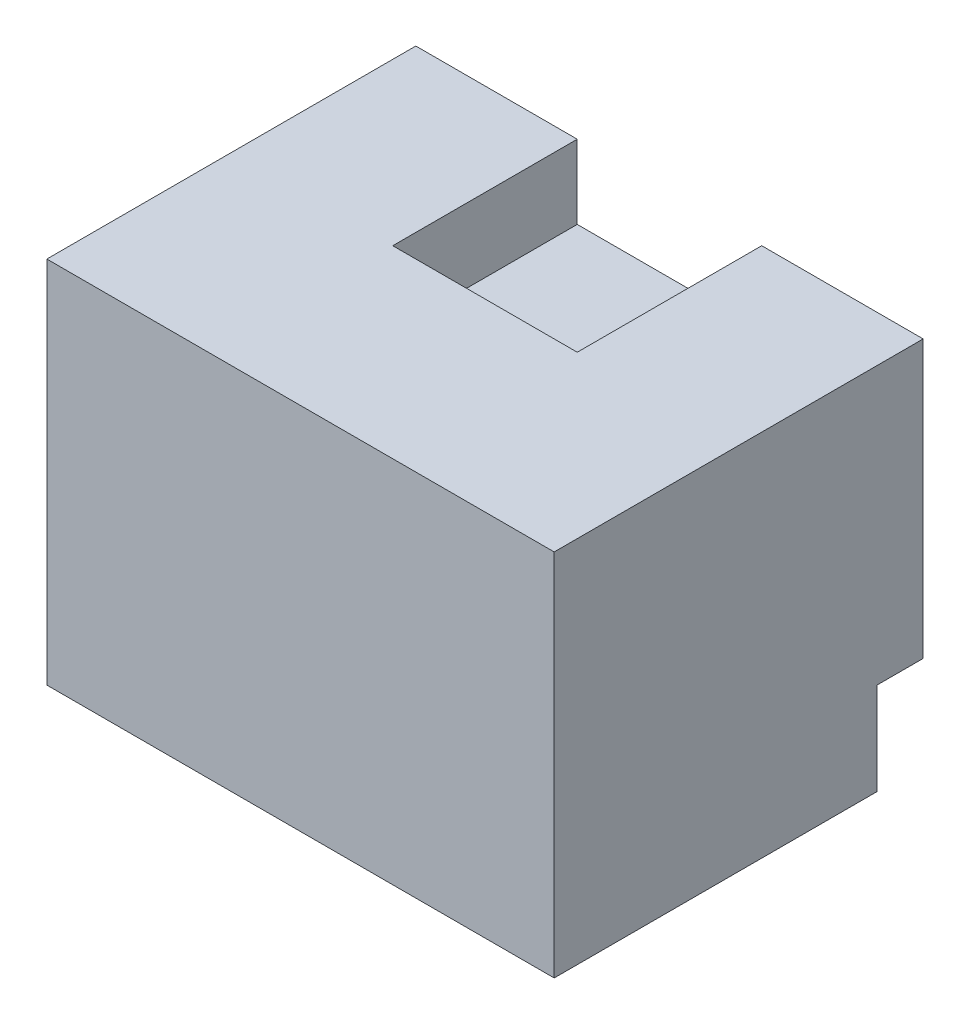
ISO-10303-21;
HEADER;
FILE_DESCRIPTION(('STEP AP214'),'2;1');
FILE_NAME('part.step','',(''),(''),'','','');
FILE_SCHEMA(('AUTOMOTIVE_DESIGN { 1 0 10303 214 1 1 1 1 }'));
ENDSEC;
DATA;
#1=APPLICATION_CONTEXT('core data for automotive mechanical design processes');
#2=APPLICATION_PROTOCOL_DEFINITION('international standard','automotive_design',2000,#1);
#3=PRODUCT_CONTEXT('',#1,'mechanical');
#4=PRODUCT('Part','Part','',(#3));
#5=PRODUCT_RELATED_PRODUCT_CATEGORY('part','',(#4));
#6=PRODUCT_DEFINITION_FORMATION('','',#4);
#7=PRODUCT_DEFINITION_CONTEXT('part definition',#1,'design');
#8=PRODUCT_DEFINITION('design','',#6,#7);
#9=PRODUCT_DEFINITION_SHAPE('','',#8);
#10=(LENGTH_UNIT() NAMED_UNIT(*) SI_UNIT(.MILLI.,.METRE.));
#11=(NAMED_UNIT(*) PLANE_ANGLE_UNIT() SI_UNIT($,.RADIAN.));
#12=(NAMED_UNIT(*) SI_UNIT($,.STERADIAN.) SOLID_ANGLE_UNIT());
#13=UNCERTAINTY_MEASURE_WITH_UNIT(LENGTH_MEASURE(1.E-05),#10,'distance_accuracy_value','');
#14=(GEOMETRIC_REPRESENTATION_CONTEXT(3) GLOBAL_UNCERTAINTY_ASSIGNED_CONTEXT((#13)) GLOBAL_UNIT_ASSIGNED_CONTEXT((#10,
#11,#12)) REPRESENTATION_CONTEXT('',''));
#15=CARTESIAN_POINT('',(0.,0.,0.));
#16=DIRECTION('',(0.,0.,1.));
#17=DIRECTION('',(1.,0.,0.));
#18=AXIS2_PLACEMENT_3D('',#15,#16,#17);
#19=CARTESIAN_POINT('',(0.,0.,0.));
#20=DIRECTION('',(0.,1.,0.));
#21=DIRECTION('',(0.,0.,1.));
#22=AXIS2_PLACEMENT_3D('',#19,#20,#21);
#23=PLANE('',#22);
#24=DIRECTION('',(1.,0.,0.));
#25=VECTOR('',#24,1.);
#26=CARTESIAN_POINT('',(27.5,0.,4.99999999999998));
#27=LINE('',#26,#25);
#28=CARTESIAN_POINT('',(-27.5,0.,4.99999999999998));
#29=VERTEX_POINT('',#28);
#30=CARTESIAN_POINT('',(27.5,0.,4.99999999999998));
#31=VERTEX_POINT('',#30);
#32=EDGE_CURVE('E59',#29,#31,#27,.T.);
#33=ORIENTED_EDGE('',*,*,#32,.F.);
#34=DIRECTION('',(0.,0.,1.));
#35=VECTOR('',#34,1.);
#36=CARTESIAN_POINT('',(-27.5,0.,0.));
#37=LINE('',#36,#35);
#38=CARTESIAN_POINT('',(-27.5,0.,0.));
#39=VERTEX_POINT('',#38);
#40=EDGE_CURVE('E180',#39,#29,#37,.T.);
#41=ORIENTED_EDGE('',*,*,#40,.F.);
#42=DIRECTION('',(1.,0.,0.));
#43=VECTOR('',#42,1.);
#44=CARTESIAN_POINT('',(0.,0.,0.));
#45=LINE('',#44,#43);
#46=CARTESIAN_POINT('',(27.5,0.,0.));
#47=VERTEX_POINT('',#46);
#48=EDGE_CURVE('E186',#39,#47,#45,.T.);
#49=ORIENTED_EDGE('',*,*,#48,.T.);
#50=DIRECTION('',(0.,0.,1.));
#51=VECTOR('',#50,1.);
#52=CARTESIAN_POINT('',(27.5,0.,0.));
#53=LINE('',#52,#51);
#54=EDGE_CURVE('E209',#47,#31,#53,.T.);
#55=ORIENTED_EDGE('',*,*,#54,.T.);
#56=EDGE_LOOP('',(#33,#41,#49,#55));
#57=FACE_BOUND('',#56,.T.);
#58=ADVANCED_FACE('F43',(#57),#23,.F.);
#59=CARTESIAN_POINT('',(0.,30.,20.));
#60=DIRECTION('',(0.,0.,1.));
#61=DIRECTION('',(1.,0.,0.));
#62=AXIS2_PLACEMENT_3D('',#59,#60,#61);
#63=PLANE('',#62);
#64=DIRECTION('',(0.,-1.,0.));
#65=VECTOR('',#64,1.);
#66=CARTESIAN_POINT('',(10.,30.,20.));
#67=LINE('',#66,#65);
#68=CARTESIAN_POINT('',(10.,30.,20.));
#69=VERTEX_POINT('',#68);
#70=CARTESIAN_POINT('',(10.,22.,20.));
#71=VERTEX_POINT('',#70);
#72=EDGE_CURVE('E205',#69,#71,#67,.T.);
#73=ORIENTED_EDGE('',*,*,#72,.T.);
#74=DIRECTION('',(-1.,0.,0.));
#75=VECTOR('',#74,1.);
#76=CARTESIAN_POINT('',(10.,22.,20.));
#77=LINE('',#76,#75);
#78=CARTESIAN_POINT('',(-9.99999999999999,22.,20.));
#79=VERTEX_POINT('',#78);
#80=EDGE_CURVE('E67',#71,#79,#77,.T.);
#81=ORIENTED_EDGE('',*,*,#80,.T.);
#82=DIRECTION('',(0.,-1.,0.));
#83=VECTOR('',#82,1.);
#84=CARTESIAN_POINT('',(-9.99999999999999,30.,20.));
#85=LINE('',#84,#83);
#86=CARTESIAN_POINT('',(-9.99999999999999,30.,20.));
#87=VERTEX_POINT('',#86);
#88=EDGE_CURVE('E11',#87,#79,#85,.T.);
#89=ORIENTED_EDGE('',*,*,#88,.F.);
#90=DIRECTION('',(-1.,0.,0.));
#91=VECTOR('',#90,1.);
#92=CARTESIAN_POINT('',(0.,30.,20.));
#93=LINE('',#92,#91);
#94=EDGE_CURVE('E181',#69,#87,#93,.T.);
#95=ORIENTED_EDGE('',*,*,#94,.F.);
#96=EDGE_LOOP('',(#73,#81,#89,#95));
#97=FACE_BOUND('',#96,.T.);
#98=ADVANCED_FACE('F45',(#97),#63,.F.);
#99=CARTESIAN_POINT('',(-9.99999999999999,30.,0.));
#100=DIRECTION('',(-1.,0.,0.));
#101=DIRECTION('',(0.,0.,1.));
#102=AXIS2_PLACEMENT_3D('',#99,#100,#101);
#103=PLANE('',#102);
#104=ORIENTED_EDGE('',*,*,#88,.T.);
#105=DIRECTION('',(0.,0.,-1.));
#106=VECTOR('',#105,1.);
#107=CARTESIAN_POINT('',(-9.99999999999999,22.,20.));
#108=LINE('',#107,#106);
#109=CARTESIAN_POINT('',(-9.99999999999999,22.,0.));
#110=VERTEX_POINT('',#109);
#111=EDGE_CURVE('E173',#79,#110,#108,.T.);
#112=ORIENTED_EDGE('',*,*,#111,.T.);
#113=DIRECTION('',(0.,-1.,0.));
#114=VECTOR('',#113,1.);
#115=CARTESIAN_POINT('',(-9.99999999999999,30.,0.));
#116=LINE('',#115,#114);
#117=CARTESIAN_POINT('',(-9.99999999999999,30.,0.));
#118=VERTEX_POINT('',#117);
#119=EDGE_CURVE('E52',#118,#110,#116,.T.);
#120=ORIENTED_EDGE('',*,*,#119,.F.);
#121=DIRECTION('',(0.,0.,-1.));
#122=VECTOR('',#121,1.);
#123=CARTESIAN_POINT('',(-9.99999999999999,30.,0.));
#124=LINE('',#123,#122);
#125=EDGE_CURVE('E185',#87,#118,#124,.T.);
#126=ORIENTED_EDGE('',*,*,#125,.F.);
#127=EDGE_LOOP('',(#104,#112,#120,#126));
#128=FACE_BOUND('',#127,.T.);
#129=ADVANCED_FACE('F270',(#128),#103,.F.);
#130=CARTESIAN_POINT('',(-27.5,30.,0.));
#131=DIRECTION('',(1.,0.,0.));
#132=DIRECTION('',(0.,0.,-1.));
#133=AXIS2_PLACEMENT_3D('',#130,#131,#132);
#134=PLANE('',#133);
#135=ORIENTED_EDGE('',*,*,#40,.T.);
#136=DIRECTION('',(0.,1.,0.));
#137=VECTOR('',#136,1.);
#138=CARTESIAN_POINT('',(-27.5,-10.,4.99999999999998));
#139=LINE('',#138,#137);
#140=CARTESIAN_POINT('',(-27.5,-10.,4.99999999999998));
#141=VERTEX_POINT('',#140);
#142=EDGE_CURVE('E164',#141,#29,#139,.T.);
#143=ORIENTED_EDGE('',*,*,#142,.F.);
#144=DIRECTION('',(0.,0.,-1.));
#145=VECTOR('',#144,1.);
#146=CARTESIAN_POINT('',(-27.5,-10.,40.));
#147=LINE('',#146,#145);
#148=CARTESIAN_POINT('',(-27.5,-10.,40.));
#149=VERTEX_POINT('',#148);
#150=EDGE_CURVE('E146',#149,#141,#147,.T.);
#151=ORIENTED_EDGE('',*,*,#150,.F.);
#152=DIRECTION('',(0.,-1.,0.));
#153=VECTOR('',#152,1.);
#154=CARTESIAN_POINT('',(-27.5,30.,40.));
#155=LINE('',#154,#153);
#156=CARTESIAN_POINT('',(-27.5,30.,40.));
#157=VERTEX_POINT('',#156);
#158=EDGE_CURVE('E136',#157,#149,#155,.T.);
#159=ORIENTED_EDGE('',*,*,#158,.F.);
#160=DIRECTION('',(0.,0.,1.));
#161=VECTOR('',#160,1.);
#162=CARTESIAN_POINT('',(-27.5,30.,0.));
#163=LINE('',#162,#161);
#164=CARTESIAN_POINT('',(-27.5,30.,0.));
#165=VERTEX_POINT('',#164);
#166=EDGE_CURVE('E193',#165,#157,#163,.T.);
#167=ORIENTED_EDGE('',*,*,#166,.F.);
#168=DIRECTION('',(0.,-1.,0.));
#169=VECTOR('',#168,1.);
#170=CARTESIAN_POINT('',(-27.5,30.,0.));
#171=LINE('',#170,#169);
#172=EDGE_CURVE('E223',#165,#39,#171,.T.);
#173=ORIENTED_EDGE('',*,*,#172,.T.);
#174=EDGE_LOOP('',(#135,#143,#151,#159,#167,#173));
#175=FACE_BOUND('',#174,.T.);
#176=ADVANCED_FACE('F250',(#175),#134,.F.);
#177=CARTESIAN_POINT('',(0.,30.,40.));
#178=DIRECTION('',(0.,0.,-1.));
#179=DIRECTION('',(-1.,0.,0.));
#180=AXIS2_PLACEMENT_3D('',#177,#178,#179);
#181=PLANE('',#180);
#182=ORIENTED_EDGE('',*,*,#158,.T.);
#183=DIRECTION('',(-1.,0.,0.));
#184=VECTOR('',#183,1.);
#185=CARTESIAN_POINT('',(27.5,-10.,40.));
#186=LINE('',#185,#184);
#187=CARTESIAN_POINT('',(27.5,-10.,40.));
#188=VERTEX_POINT('',#187);
#189=EDGE_CURVE('E140',#188,#149,#186,.T.);
#190=ORIENTED_EDGE('',*,*,#189,.F.);
#191=DIRECTION('',(0.,-1.,0.));
#192=VECTOR('',#191,1.);
#193=CARTESIAN_POINT('',(27.5,30.,40.));
#194=LINE('',#193,#192);
#195=CARTESIAN_POINT('',(27.5,30.,40.));
#196=VERTEX_POINT('',#195);
#197=EDGE_CURVE('E124',#196,#188,#194,.T.);
#198=ORIENTED_EDGE('',*,*,#197,.F.);
#199=DIRECTION('',(1.,0.,0.));
#200=VECTOR('',#199,1.);
#201=CARTESIAN_POINT('',(0.,30.,40.));
#202=LINE('',#201,#200);
#203=EDGE_CURVE('E197',#157,#196,#202,.T.);
#204=ORIENTED_EDGE('',*,*,#203,.F.);
#205=EDGE_LOOP('',(#182,#190,#198,#204));
#206=FACE_BOUND('',#205,.T.);
#207=ADVANCED_FACE('F141',(#206),#181,.F.);
#208=CARTESIAN_POINT('',(27.5,30.,0.));
#209=DIRECTION('',(1.,0.,0.));
#210=DIRECTION('',(0.,0.,-1.));
#211=AXIS2_PLACEMENT_3D('',#208,#209,#210);
#212=PLANE('',#211);
#213=ORIENTED_EDGE('',*,*,#54,.F.);
#214=DIRECTION('',(0.,-1.,0.));
#215=VECTOR('',#214,1.);
#216=CARTESIAN_POINT('',(27.5,30.,0.));
#217=LINE('',#216,#215);
#218=CARTESIAN_POINT('',(27.5,30.,0.));
#219=VERTEX_POINT('',#218);
#220=EDGE_CURVE('E137',#219,#47,#217,.T.);
#221=ORIENTED_EDGE('',*,*,#220,.F.);
#222=DIRECTION('',(0.,0.,1.));
#223=VECTOR('',#222,1.);
#224=CARTESIAN_POINT('',(27.5,30.,0.));
#225=LINE('',#224,#223);
#226=EDGE_CURVE('E132',#219,#196,#225,.T.);
#227=ORIENTED_EDGE('',*,*,#226,.T.);
#228=ORIENTED_EDGE('',*,*,#197,.T.);
#229=DIRECTION('',(0.,0.,1.));
#230=VECTOR('',#229,1.);
#231=CARTESIAN_POINT('',(27.5,-10.,40.));
#232=LINE('',#231,#230);
#233=CARTESIAN_POINT('',(27.5,-10.,4.99999999999998));
#234=VERTEX_POINT('',#233);
#235=EDGE_CURVE('E130',#234,#188,#232,.T.);
#236=ORIENTED_EDGE('',*,*,#235,.F.);
#237=DIRECTION('',(0.,1.,0.));
#238=VECTOR('',#237,1.);
#239=CARTESIAN_POINT('',(27.5,-10.,4.99999999999998));
#240=LINE('',#239,#238);
#241=EDGE_CURVE('E160',#234,#31,#240,.T.);
#242=ORIENTED_EDGE('',*,*,#241,.T.);
#243=EDGE_LOOP('',(#213,#221,#227,#228,#236,#242));
#244=FACE_BOUND('',#243,.T.);
#245=ADVANCED_FACE('F127',(#244),#212,.T.);
#246=CARTESIAN_POINT('',(0.,30.,0.));
#247=DIRECTION('',(0.,0.,-1.));
#248=DIRECTION('',(-1.,0.,0.));
#249=AXIS2_PLACEMENT_3D('',#246,#247,#248);
#250=PLANE('',#249);
#251=ORIENTED_EDGE('',*,*,#48,.F.);
#252=ORIENTED_EDGE('',*,*,#172,.F.);
#253=DIRECTION('',(1.,0.,0.));
#254=VECTOR('',#253,1.);
#255=CARTESIAN_POINT('',(0.,30.,0.));
#256=LINE('',#255,#254);
#257=EDGE_CURVE('E189',#165,#118,#256,.T.);
#258=ORIENTED_EDGE('',*,*,#257,.T.);
#259=ORIENTED_EDGE('',*,*,#119,.T.);
#260=DIRECTION('',(1.,0.,0.));
#261=VECTOR('',#260,1.);
#262=CARTESIAN_POINT('',(10.,22.,0.));
#263=LINE('',#262,#261);
#264=CARTESIAN_POINT('',(10.,22.,0.));
#265=VERTEX_POINT('',#264);
#266=EDGE_CURVE('E176',#110,#265,#263,.T.);
#267=ORIENTED_EDGE('',*,*,#266,.T.);
#268=DIRECTION('',(0.,-1.,0.));
#269=VECTOR('',#268,1.);
#270=CARTESIAN_POINT('',(10.,30.,0.));
#271=LINE('',#270,#269);
#272=CARTESIAN_POINT('',(10.,30.,0.));
#273=VERTEX_POINT('',#272);
#274=EDGE_CURVE('E216',#273,#265,#271,.T.);
#275=ORIENTED_EDGE('',*,*,#274,.F.);
#276=EDGE_CURVE('E194',#273,#219,#256,.T.);
#277=ORIENTED_EDGE('',*,*,#276,.T.);
#278=ORIENTED_EDGE('',*,*,#220,.T.);
#279=EDGE_LOOP('',(#251,#252,#258,#259,#267,#275,#277,#278));
#280=FACE_BOUND('',#279,.T.);
#281=ADVANCED_FACE('F231',(#280),#250,.T.);
#282=CARTESIAN_POINT('',(10.,30.,0.));
#283=DIRECTION('',(1.,0.,0.));
#284=DIRECTION('',(0.,0.,-1.));
#285=AXIS2_PLACEMENT_3D('',#282,#283,#284);
#286=PLANE('',#285);
#287=ORIENTED_EDGE('',*,*,#274,.T.);
#288=DIRECTION('',(0.,0.,1.));
#289=VECTOR('',#288,1.);
#290=CARTESIAN_POINT('',(10.,22.,20.));
#291=LINE('',#290,#289);
#292=EDGE_CURVE('E168',#265,#71,#291,.T.);
#293=ORIENTED_EDGE('',*,*,#292,.T.);
#294=ORIENTED_EDGE('',*,*,#72,.F.);
#295=DIRECTION('',(0.,0.,1.));
#296=VECTOR('',#295,1.);
#297=CARTESIAN_POINT('',(10.,30.,0.));
#298=LINE('',#297,#296);
#299=EDGE_CURVE('E202',#273,#69,#298,.T.);
#300=ORIENTED_EDGE('',*,*,#299,.F.);
#301=EDGE_LOOP('',(#287,#293,#294,#300));
#302=FACE_BOUND('',#301,.T.);
#303=ADVANCED_FACE('F240',(#302),#286,.F.);
#304=CARTESIAN_POINT('',(0.,30.,0.));
#305=DIRECTION('',(0.,1.,0.));
#306=DIRECTION('',(0.,0.,1.));
#307=AXIS2_PLACEMENT_3D('',#304,#305,#306);
#308=PLANE('',#307);
#309=ORIENTED_EDGE('',*,*,#94,.T.);
#310=ORIENTED_EDGE('',*,*,#125,.T.);
#311=ORIENTED_EDGE('',*,*,#257,.F.);
#312=ORIENTED_EDGE('',*,*,#166,.T.);
#313=ORIENTED_EDGE('',*,*,#203,.T.);
#314=ORIENTED_EDGE('',*,*,#226,.F.);
#315=ORIENTED_EDGE('',*,*,#276,.F.);
#316=ORIENTED_EDGE('',*,*,#299,.T.);
#317=EDGE_LOOP('',(#309,#310,#311,#312,#313,#314,#315,#316));
#318=FACE_BOUND('',#317,.T.);
#319=ADVANCED_FACE('F244',(#318),#308,.T.);
#320=CARTESIAN_POINT('',(0.,22.,0.));
#321=DIRECTION('',(0.,1.,0.));
#322=DIRECTION('',(0.,0.,1.));
#323=AXIS2_PLACEMENT_3D('',#320,#321,#322);
#324=PLANE('',#323);
#325=ORIENTED_EDGE('',*,*,#292,.F.);
#326=ORIENTED_EDGE('',*,*,#266,.F.);
#327=ORIENTED_EDGE('',*,*,#111,.F.);
#328=ORIENTED_EDGE('',*,*,#80,.F.);
#329=EDGE_LOOP('',(#325,#326,#327,#328));
#330=FACE_BOUND('',#329,.T.);
#331=ADVANCED_FACE('F237',(#330),#324,.T.);
#332=CARTESIAN_POINT('',(27.5,-10.,4.99999999999998));
#333=DIRECTION('',(0.,0.,1.));
#334=DIRECTION('',(1.,0.,0.));
#335=AXIS2_PLACEMENT_3D('',#332,#333,#334);
#336=PLANE('',#335);
#337=ORIENTED_EDGE('',*,*,#32,.T.);
#338=ORIENTED_EDGE('',*,*,#241,.F.);
#339=DIRECTION('',(1.,0.,0.));
#340=VECTOR('',#339,1.);
#341=CARTESIAN_POINT('',(27.5,-10.,4.99999999999998));
#342=LINE('',#341,#340);
#343=EDGE_CURVE('E150',#141,#234,#342,.T.);
#344=ORIENTED_EDGE('',*,*,#343,.F.);
#345=ORIENTED_EDGE('',*,*,#142,.T.);
#346=EDGE_LOOP('',(#337,#338,#344,#345));
#347=FACE_BOUND('',#346,.T.);
#348=ADVANCED_FACE('F253',(#347),#336,.F.);
#349=CARTESIAN_POINT('',(0.,-10.,0.));
#350=DIRECTION('',(0.,1.,0.));
#351=DIRECTION('',(0.,0.,1.));
#352=AXIS2_PLACEMENT_3D('',#349,#350,#351);
#353=PLANE('',#352);
#354=ORIENTED_EDGE('',*,*,#235,.T.);
#355=ORIENTED_EDGE('',*,*,#189,.T.);
#356=ORIENTED_EDGE('',*,*,#150,.T.);
#357=ORIENTED_EDGE('',*,*,#343,.T.);
#358=EDGE_LOOP('',(#354,#355,#356,#357));
#359=FACE_BOUND('',#358,.T.);
#360=ADVANCED_FACE('F148',(#359),#353,.F.);
#361=CLOSED_SHELL('',(#58,#98,#129,#176,#207,#245,#281,#303,#319,#331,#348,#360));
#362=MANIFOLD_SOLID_BREP('B2',#361);
#363=ADVANCED_BREP_SHAPE_REPRESENTATION('',(#18,#362),#14);
#364=SHAPE_DEFINITION_REPRESENTATION(#9,#363);
ENDSEC;
END-ISO-10303-21;
